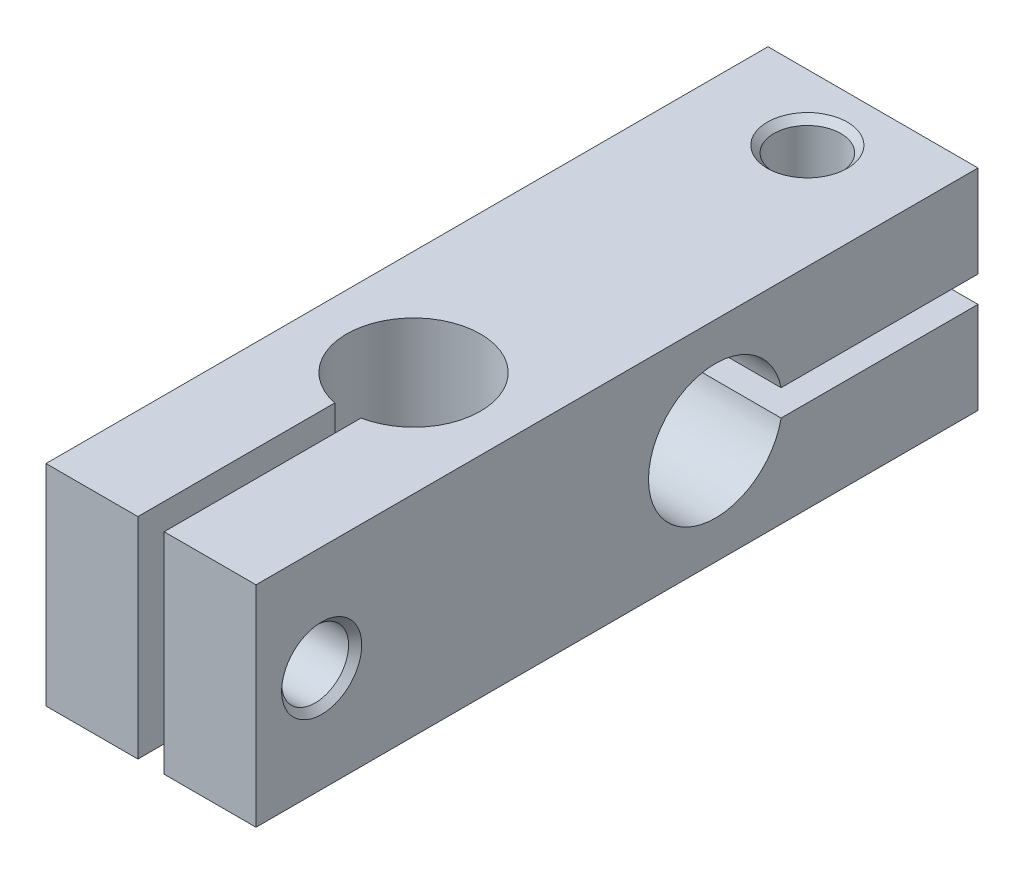
ISO-10303-21;
HEADER;
FILE_DESCRIPTION(('STEP AP214'),'2;1');
FILE_NAME('part.step','',(''),(''),'','','');
FILE_SCHEMA(('AUTOMOTIVE_DESIGN { 1 0 10303 214 1 1 1 1 }'));
ENDSEC;
DATA;
#1=APPLICATION_CONTEXT('core data for automotive mechanical design processes');
#2=APPLICATION_PROTOCOL_DEFINITION('international standard','automotive_design',2000,#1);
#3=PRODUCT_CONTEXT('',#1,'mechanical');
#4=PRODUCT('Part','Part','',(#3));
#5=PRODUCT_RELATED_PRODUCT_CATEGORY('part','',(#4));
#6=PRODUCT_DEFINITION_FORMATION('','',#4);
#7=PRODUCT_DEFINITION_CONTEXT('part definition',#1,'design');
#8=PRODUCT_DEFINITION('design','',#6,#7);
#9=PRODUCT_DEFINITION_SHAPE('','',#8);
#10=(LENGTH_UNIT() NAMED_UNIT(*) SI_UNIT(.MILLI.,.METRE.));
#11=(NAMED_UNIT(*) PLANE_ANGLE_UNIT() SI_UNIT($,.RADIAN.));
#12=(NAMED_UNIT(*) SI_UNIT($,.STERADIAN.) SOLID_ANGLE_UNIT());
#13=UNCERTAINTY_MEASURE_WITH_UNIT(LENGTH_MEASURE(1.E-05),#10,'distance_accuracy_value','');
#14=(GEOMETRIC_REPRESENTATION_CONTEXT(3) GLOBAL_UNCERTAINTY_ASSIGNED_CONTEXT((#13)) GLOBAL_UNIT_ASSIGNED_CONTEXT((#10,
#11,#12)) REPRESENTATION_CONTEXT('',''));
#15=CARTESIAN_POINT('',(0.,0.,0.));
#16=DIRECTION('',(0.,0.,1.));
#17=DIRECTION('',(1.,0.,0.));
#18=AXIS2_PLACEMENT_3D('',#15,#16,#17);
#19=CARTESIAN_POINT('',(0.,0.,0.));
#20=DIRECTION('',(0.,0.,1.));
#21=DIRECTION('',(1.,0.,0.));
#22=AXIS2_PLACEMENT_3D('',#19,#20,#21);
#23=PLANE('',#22);
#24=DIRECTION('',(0.,1.,0.));
#25=VECTOR('',#24,1.);
#26=CARTESIAN_POINT('',(8.,-8.,0.));
#27=LINE('',#26,#25);
#28=CARTESIAN_POINT('',(8.,1.,0.));
#29=VERTEX_POINT('',#28);
#30=CARTESIAN_POINT('',(8.,8.,0.));
#31=VERTEX_POINT('',#30);
#32=EDGE_CURVE('E209',#29,#31,#27,.T.);
#33=ORIENTED_EDGE('',*,*,#32,.F.);
#34=DIRECTION('',(-1.,0.,0.));
#35=VECTOR('',#34,1.);
#36=CARTESIAN_POINT('',(8.,1.,0.));
#37=LINE('',#36,#35);
#38=CARTESIAN_POINT('',(-8.,1.,0.));
#39=VERTEX_POINT('',#38);
#40=EDGE_CURVE('E140',#29,#39,#37,.T.);
#41=ORIENTED_EDGE('',*,*,#40,.T.);
#42=DIRECTION('',(0.,-1.,0.));
#43=VECTOR('',#42,1.);
#44=CARTESIAN_POINT('',(-8.,-8.,0.));
#45=LINE('',#44,#43);
#46=CARTESIAN_POINT('',(-8.,8.,0.));
#47=VERTEX_POINT('',#46);
#48=EDGE_CURVE('E204',#47,#39,#45,.T.);
#49=ORIENTED_EDGE('',*,*,#48,.F.);
#50=DIRECTION('',(-1.,0.,0.));
#51=VECTOR('',#50,1.);
#52=CARTESIAN_POINT('',(8.,8.,0.));
#53=LINE('',#52,#51);
#54=EDGE_CURVE('E193',#31,#47,#53,.T.);
#55=ORIENTED_EDGE('',*,*,#54,.F.);
#56=EDGE_LOOP('',(#33,#41,#49,#55));
#57=FACE_BOUND('',#56,.T.);
#58=ADVANCED_FACE('F36',(#57),#23,.F.);
#59=CARTESIAN_POINT('',(8.,8.,55.));
#60=DIRECTION('',(0.,-1.,0.));
#61=DIRECTION('',(1.,0.,0.));
#62=AXIS2_PLACEMENT_3D('',#59,#60,#61);
#63=PLANE('',#62);
#64=CARTESIAN_POINT('',(0.,8.,5.));
#65=DIRECTION('',(0.,1.,0.));
#66=DIRECTION('',(0.,0.,1.));
#67=AXIS2_PLACEMENT_3D('',#64,#65,#66);
#68=CIRCLE('',#67,3.05);
#69=CARTESIAN_POINT('',(0.,8.,8.05));
#70=VERTEX_POINT('',#69);
#71=EDGE_CURVE('E266',#70,#70,#68,.T.);
#72=ORIENTED_EDGE('',*,*,#71,.F.);
#73=EDGE_LOOP('',(#72));
#74=FACE_BOUND('',#73,.T.);
#75=CARTESIAN_POINT('',(0.,8.,35.));
#76=DIRECTION('',(0.,1.,0.));
#77=DIRECTION('',(0.,0.,1.));
#78=AXIS2_PLACEMENT_3D('',#75,#76,#77);
#79=CIRCLE('',#78,5.09999999999999);
#80=CARTESIAN_POINT('',(1.,8.,40.00099990002));
#81=VERTEX_POINT('',#80);
#82=CARTESIAN_POINT('',(-0.999999999999997,8.,40.00099990002));
#83=VERTEX_POINT('',#82);
#84=EDGE_CURVE('E151',#81,#83,#79,.T.);
#85=ORIENTED_EDGE('',*,*,#84,.F.);
#86=DIRECTION('',(0.,0.,-1.));
#87=VECTOR('',#86,1.);
#88=CARTESIAN_POINT('',(1.00000000000001,8.,0.));
#89=LINE('',#88,#87);
#90=CARTESIAN_POINT('',(1.00000000000001,8.,55.));
#91=VERTEX_POINT('',#90);
#92=EDGE_CURVE('E175',#91,#81,#89,.T.);
#93=ORIENTED_EDGE('',*,*,#92,.F.);
#94=DIRECTION('',(-1.,0.,0.));
#95=VECTOR('',#94,1.);
#96=CARTESIAN_POINT('',(8.,8.,55.));
#97=LINE('',#96,#95);
#98=CARTESIAN_POINT('',(8.,8.,55.));
#99=VERTEX_POINT('',#98);
#100=EDGE_CURVE('E200',#99,#91,#97,.T.);
#101=ORIENTED_EDGE('',*,*,#100,.F.);
#102=DIRECTION('',(0.,0.,-1.));
#103=VECTOR('',#102,1.);
#104=CARTESIAN_POINT('',(8.,8.,55.));
#105=LINE('',#104,#103);
#106=EDGE_CURVE('E215',#99,#31,#105,.T.);
#107=ORIENTED_EDGE('',*,*,#106,.T.);
#108=ORIENTED_EDGE('',*,*,#54,.T.);
#109=DIRECTION('',(0.,0.,-1.));
#110=VECTOR('',#109,1.);
#111=CARTESIAN_POINT('',(-8.,8.,55.));
#112=LINE('',#111,#110);
#113=CARTESIAN_POINT('',(-8.,8.,55.));
#114=VERTEX_POINT('',#113);
#115=EDGE_CURVE('E203',#114,#47,#112,.T.);
#116=ORIENTED_EDGE('',*,*,#115,.F.);
#117=CARTESIAN_POINT('',(-0.999999999999997,8.,55.));
#118=VERTEX_POINT('',#117);
#119=EDGE_CURVE('E199',#118,#114,#97,.T.);
#120=ORIENTED_EDGE('',*,*,#119,.F.);
#121=DIRECTION('',(0.,0.,-1.));
#122=VECTOR('',#121,1.);
#123=CARTESIAN_POINT('',(-1.00000000000001,8.,0.));
#124=LINE('',#123,#122);
#125=EDGE_CURVE('E179',#118,#83,#124,.T.);
#126=ORIENTED_EDGE('',*,*,#125,.T.);
#127=EDGE_LOOP('',(#85,#93,#101,#107,#108,#116,#120,#126));
#128=FACE_BOUND('',#127,.T.);
#129=ADVANCED_FACE('F244',(#74,#128),#63,.F.);
#130=CARTESIAN_POINT('',(0.,0.,55.));
#131=DIRECTION('',(0.,0.,1.));
#132=DIRECTION('',(1.,0.,0.));
#133=AXIS2_PLACEMENT_3D('',#130,#131,#132);
#134=PLANE('',#133);
#135=DIRECTION('',(1.,0.,0.));
#136=VECTOR('',#135,1.);
#137=CARTESIAN_POINT('',(8.,-8.,55.));
#138=LINE('',#137,#136);
#139=CARTESIAN_POINT('',(-8.,-8.,55.));
#140=VERTEX_POINT('',#139);
#141=CARTESIAN_POINT('',(-0.999999999999994,-8.,55.));
#142=VERTEX_POINT('',#141);
#143=EDGE_CURVE('E194',#140,#142,#138,.T.);
#144=ORIENTED_EDGE('',*,*,#143,.T.);
#145=DIRECTION('',(0.,1.,0.));
#146=VECTOR('',#145,1.);
#147=CARTESIAN_POINT('',(-0.999999999999994,-8.,55.));
#148=LINE('',#147,#146);
#149=EDGE_CURVE('E178',#142,#118,#148,.T.);
#150=ORIENTED_EDGE('',*,*,#149,.T.);
#151=ORIENTED_EDGE('',*,*,#119,.T.);
#152=DIRECTION('',(0.,-1.,0.));
#153=VECTOR('',#152,1.);
#154=CARTESIAN_POINT('',(-8.,-8.,55.));
#155=LINE('',#154,#153);
#156=EDGE_CURVE('E189',#114,#140,#155,.T.);
#157=ORIENTED_EDGE('',*,*,#156,.T.);
#158=EDGE_LOOP('',(#144,#150,#151,#157));
#159=FACE_BOUND('',#158,.T.);
#160=ADVANCED_FACE('F241',(#159),#134,.T.);
#161=CARTESIAN_POINT('',(-8.,-8.,55.));
#162=DIRECTION('',(1.,0.,0.));
#163=DIRECTION('',(0.,0.,-1.));
#164=AXIS2_PLACEMENT_3D('',#161,#162,#163);
#165=PLANE('',#164);
#166=CARTESIAN_POINT('',(-8.,0.,50.));
#167=DIRECTION('',(-1.,0.,0.));
#168=DIRECTION('',(0.,0.,1.));
#169=AXIS2_PLACEMENT_3D('',#166,#167,#168);
#170=CIRCLE('',#169,2.1);
#171=CARTESIAN_POINT('',(-8.,0.,52.1));
#172=VERTEX_POINT('',#171);
#173=EDGE_CURVE('E160',#172,#172,#170,.T.);
#174=ORIENTED_EDGE('',*,*,#173,.F.);
#175=EDGE_LOOP('',(#174));
#176=FACE_BOUND('',#175,.T.);
#177=DIRECTION('',(0.,0.,-1.));
#178=VECTOR('',#177,1.);
#179=CARTESIAN_POINT('',(-8.,1.,0.));
#180=LINE('',#179,#178);
#181=CARTESIAN_POINT('',(-8.,0.999999999999999,14.99900009998));
#182=VERTEX_POINT('',#181);
#183=EDGE_CURVE('E145',#182,#39,#180,.T.);
#184=ORIENTED_EDGE('',*,*,#183,.F.);
#185=CARTESIAN_POINT('',(-8.,0.,20.));
#186=DIRECTION('',(-1.,0.,0.));
#187=DIRECTION('',(0.,0.,1.));
#188=AXIS2_PLACEMENT_3D('',#185,#186,#187);
#189=CIRCLE('',#188,5.09999999999999);
#190=CARTESIAN_POINT('',(-8.,-0.999999999999999,14.99900009998));
#191=VERTEX_POINT('',#190);
#192=EDGE_CURVE('E126',#191,#182,#189,.T.);
#193=ORIENTED_EDGE('',*,*,#192,.F.);
#194=DIRECTION('',(0.,0.,1.));
#195=VECTOR('',#194,1.);
#196=CARTESIAN_POINT('',(-8.,-1.,0.));
#197=LINE('',#196,#195);
#198=CARTESIAN_POINT('',(-8.,-1.,0.));
#199=VERTEX_POINT('',#198);
#200=EDGE_CURVE('E130',#199,#191,#197,.T.);
#201=ORIENTED_EDGE('',*,*,#200,.F.);
#202=CARTESIAN_POINT('',(-8.,-8.,0.));
#203=VERTEX_POINT('',#202);
#204=EDGE_CURVE('E186',#199,#203,#45,.T.);
#205=ORIENTED_EDGE('',*,*,#204,.T.);
#206=DIRECTION('',(0.,0.,-1.));
#207=VECTOR('',#206,1.);
#208=CARTESIAN_POINT('',(-8.,-8.,55.));
#209=LINE('',#208,#207);
#210=EDGE_CURVE('E221',#140,#203,#209,.T.);
#211=ORIENTED_EDGE('',*,*,#210,.F.);
#212=ORIENTED_EDGE('',*,*,#156,.F.);
#213=ORIENTED_EDGE('',*,*,#115,.T.);
#214=ORIENTED_EDGE('',*,*,#48,.T.);
#215=EDGE_LOOP('',(#184,#193,#201,#205,#211,#212,#213,#214));
#216=FACE_BOUND('',#215,.T.);
#217=ADVANCED_FACE('F38',(#176,#216),#165,.F.);
#218=CARTESIAN_POINT('',(8.,-8.,55.));
#219=DIRECTION('',(0.,1.,0.));
#220=DIRECTION('',(-1.,0.,0.));
#221=AXIS2_PLACEMENT_3D('',#218,#219,#220);
#222=PLANE('',#221);
#223=CARTESIAN_POINT('',(0.,-8.,5.));
#224=DIRECTION('',(0.,-1.,0.));
#225=DIRECTION('',(0.,0.,-1.));
#226=AXIS2_PLACEMENT_3D('',#223,#224,#225);
#227=CIRCLE('',#226,2.09999999999999);
#228=CARTESIAN_POINT('',(0.,-8.,2.90000000000001));
#229=VERTEX_POINT('',#228);
#230=EDGE_CURVE('E272',#229,#229,#227,.T.);
#231=ORIENTED_EDGE('',*,*,#230,.F.);
#232=EDGE_LOOP('',(#231));
#233=FACE_BOUND('',#232,.T.);
#234=DIRECTION('',(0.,0.,-1.));
#235=VECTOR('',#234,1.);
#236=CARTESIAN_POINT('',(1.00000000000001,-8.,0.));
#237=LINE('',#236,#235);
#238=CARTESIAN_POINT('',(1.00000000000001,-8.,55.));
#239=VERTEX_POINT('',#238);
#240=CARTESIAN_POINT('',(1.00000000000001,-8.,40.00099990002));
#241=VERTEX_POINT('',#240);
#242=EDGE_CURVE('E174',#239,#241,#237,.T.);
#243=ORIENTED_EDGE('',*,*,#242,.T.);
#244=CARTESIAN_POINT('',(0.,-8.,35.));
#245=DIRECTION('',(0.,1.,0.));
#246=DIRECTION('',(0.,0.,1.));
#247=AXIS2_PLACEMENT_3D('',#244,#245,#246);
#248=CIRCLE('',#247,5.1);
#249=CARTESIAN_POINT('',(-0.999999999999995,-8.,40.00099990002));
#250=VERTEX_POINT('',#249);
#251=EDGE_CURVE('E154',#241,#250,#248,.T.);
#252=ORIENTED_EDGE('',*,*,#251,.T.);
#253=DIRECTION('',(0.,0.,-1.));
#254=VECTOR('',#253,1.);
#255=CARTESIAN_POINT('',(-1.00000000000001,-8.,0.));
#256=LINE('',#255,#254);
#257=EDGE_CURVE('E171',#142,#250,#256,.T.);
#258=ORIENTED_EDGE('',*,*,#257,.F.);
#259=ORIENTED_EDGE('',*,*,#143,.F.);
#260=ORIENTED_EDGE('',*,*,#210,.T.);
#261=DIRECTION('',(1.,0.,0.));
#262=VECTOR('',#261,1.);
#263=CARTESIAN_POINT('',(8.,-8.,0.));
#264=LINE('',#263,#262);
#265=CARTESIAN_POINT('',(8.,-8.,0.));
#266=VERTEX_POINT('',#265);
#267=EDGE_CURVE('E207',#203,#266,#264,.T.);
#268=ORIENTED_EDGE('',*,*,#267,.T.);
#269=DIRECTION('',(0.,0.,-1.));
#270=VECTOR('',#269,1.);
#271=CARTESIAN_POINT('',(8.,-8.,55.));
#272=LINE('',#271,#270);
#273=CARTESIAN_POINT('',(8.,-8.,55.));
#274=VERTEX_POINT('',#273);
#275=EDGE_CURVE('E218',#274,#266,#272,.T.);
#276=ORIENTED_EDGE('',*,*,#275,.F.);
#277=EDGE_CURVE('E192',#239,#274,#138,.T.);
#278=ORIENTED_EDGE('',*,*,#277,.F.);
#279=EDGE_LOOP('',(#243,#252,#258,#259,#260,#268,#276,#278));
#280=FACE_BOUND('',#279,.T.);
#281=ADVANCED_FACE('F235',(#233,#280),#222,.F.);
#282=CARTESIAN_POINT('',(8.,-8.,55.));
#283=DIRECTION('',(-1.,0.,0.));
#284=DIRECTION('',(0.,0.,1.));
#285=AXIS2_PLACEMENT_3D('',#282,#283,#284);
#286=PLANE('',#285);
#287=CARTESIAN_POINT('',(8.,0.,50.));
#288=DIRECTION('',(1.,0.,0.));
#289=DIRECTION('',(0.,0.,-1.));
#290=AXIS2_PLACEMENT_3D('',#287,#288,#289);
#291=CIRCLE('',#290,3.05);
#292=CARTESIAN_POINT('',(8.,0.,46.95));
#293=VERTEX_POINT('',#292);
#294=EDGE_CURVE('E164',#293,#293,#291,.T.);
#295=ORIENTED_EDGE('',*,*,#294,.F.);
#296=EDGE_LOOP('',(#295));
#297=FACE_BOUND('',#296,.T.);
#298=DIRECTION('',(0.,0.,1.));
#299=VECTOR('',#298,1.);
#300=CARTESIAN_POINT('',(8.,-1.,0.));
#301=LINE('',#300,#299);
#302=CARTESIAN_POINT('',(8.,-1.,0.));
#303=VERTEX_POINT('',#302);
#304=CARTESIAN_POINT('',(8.,-1.,14.99900009998));
#305=VERTEX_POINT('',#304);
#306=EDGE_CURVE('E58',#303,#305,#301,.T.);
#307=ORIENTED_EDGE('',*,*,#306,.T.);
#308=CARTESIAN_POINT('',(8.,0.,20.));
#309=DIRECTION('',(-1.,0.,0.));
#310=DIRECTION('',(0.,0.,1.));
#311=AXIS2_PLACEMENT_3D('',#308,#309,#310);
#312=CIRCLE('',#311,5.1);
#313=CARTESIAN_POINT('',(8.,1.,14.99900009998));
#314=VERTEX_POINT('',#313);
#315=EDGE_CURVE('E52',#305,#314,#312,.T.);
#316=ORIENTED_EDGE('',*,*,#315,.T.);
#317=DIRECTION('',(0.,0.,-1.));
#318=VECTOR('',#317,1.);
#319=CARTESIAN_POINT('',(8.,1.,0.));
#320=LINE('',#319,#318);
#321=EDGE_CURVE('E134',#314,#29,#320,.T.);
#322=ORIENTED_EDGE('',*,*,#321,.T.);
#323=ORIENTED_EDGE('',*,*,#32,.T.);
#324=ORIENTED_EDGE('',*,*,#106,.F.);
#325=DIRECTION('',(0.,1.,0.));
#326=VECTOR('',#325,1.);
#327=CARTESIAN_POINT('',(8.,-8.,55.));
#328=LINE('',#327,#326);
#329=EDGE_CURVE('E197',#274,#99,#328,.T.);
#330=ORIENTED_EDGE('',*,*,#329,.F.);
#331=ORIENTED_EDGE('',*,*,#275,.T.);
#332=EDGE_CURVE('E210',#266,#303,#27,.T.);
#333=ORIENTED_EDGE('',*,*,#332,.T.);
#334=EDGE_LOOP('',(#307,#316,#322,#323,#324,#330,#331,#333));
#335=FACE_BOUND('',#334,.T.);
#336=ADVANCED_FACE('F133',(#297,#335),#286,.F.);
#337=DIRECTION('',(0.,1.,0.));
#338=VECTOR('',#337,1.);
#339=CARTESIAN_POINT('',(1.00000000000001,-8.,55.));
#340=LINE('',#339,#338);
#341=EDGE_CURVE('E184',#239,#91,#340,.T.);
#342=ORIENTED_EDGE('',*,*,#341,.F.);
#343=ORIENTED_EDGE('',*,*,#277,.T.);
#344=ORIENTED_EDGE('',*,*,#329,.T.);
#345=ORIENTED_EDGE('',*,*,#100,.T.);
#346=EDGE_LOOP('',(#342,#343,#344,#345));
#347=FACE_BOUND('',#346,.T.);
#348=ADVANCED_FACE('F284',(#347),#134,.T.);
#349=ORIENTED_EDGE('',*,*,#204,.F.);
#350=DIRECTION('',(-1.,0.,0.));
#351=VECTOR('',#350,1.);
#352=CARTESIAN_POINT('',(8.,-1.,0.));
#353=LINE('',#352,#351);
#354=EDGE_CURVE('E142',#303,#199,#353,.T.);
#355=ORIENTED_EDGE('',*,*,#354,.F.);
#356=ORIENTED_EDGE('',*,*,#332,.F.);
#357=ORIENTED_EDGE('',*,*,#267,.F.);
#358=EDGE_LOOP('',(#349,#355,#356,#357));
#359=FACE_BOUND('',#358,.T.);
#360=ADVANCED_FACE('F258',(#359),#23,.F.);
#361=CARTESIAN_POINT('',(1.00000000000001,-8.,0.));
#362=DIRECTION('',(1.,0.,0.));
#363=DIRECTION('',(0.,1.,0.));
#364=AXIS2_PLACEMENT_3D('',#361,#362,#363);
#365=PLANE('',#364);
#366=CARTESIAN_POINT('',(1.00000000000001,0.,50.));
#367=DIRECTION('',(1.,0.,0.));
#368=DIRECTION('',(0.,1.,0.));
#369=AXIS2_PLACEMENT_3D('',#366,#367,#368);
#370=CIRCLE('',#369,2.54999999999999);
#371=CARTESIAN_POINT('',(1.00000000000001,2.54999999999999,50.));
#372=VERTEX_POINT('',#371);
#373=EDGE_CURVE('E170',#372,#372,#370,.T.);
#374=ORIENTED_EDGE('',*,*,#373,.T.);
#375=EDGE_LOOP('',(#374));
#376=FACE_BOUND('',#375,.T.);
#377=ORIENTED_EDGE('',*,*,#92,.T.);
#378=DIRECTION('',(0.,1.,0.));
#379=VECTOR('',#378,1.);
#380=CARTESIAN_POINT('',(1.00000000000001,8.,40.00099990002));
#381=LINE('',#380,#379);
#382=EDGE_CURVE('E157',#81,#241,#381,.F.);
#383=ORIENTED_EDGE('',*,*,#382,.T.);
#384=ORIENTED_EDGE('',*,*,#242,.F.);
#385=ORIENTED_EDGE('',*,*,#341,.T.);
#386=EDGE_LOOP('',(#377,#383,#384,#385));
#387=FACE_BOUND('',#386,.T.);
#388=ADVANCED_FACE('F298',(#376,#387),#365,.F.);
#389=CARTESIAN_POINT('',(-1.00000000000001,-8.,0.));
#390=DIRECTION('',(1.,0.,0.));
#391=DIRECTION('',(0.,0.,-1.));
#392=AXIS2_PLACEMENT_3D('',#389,#390,#391);
#393=PLANE('',#392);
#394=DIRECTION('',(0.,1.,0.));
#395=VECTOR('',#394,1.);
#396=CARTESIAN_POINT('',(-0.999999999999997,8.,40.00099990002));
#397=LINE('',#396,#395);
#398=EDGE_CURVE('E45',#83,#250,#397,.F.);
#399=ORIENTED_EDGE('',*,*,#398,.F.);
#400=ORIENTED_EDGE('',*,*,#125,.F.);
#401=ORIENTED_EDGE('',*,*,#149,.F.);
#402=ORIENTED_EDGE('',*,*,#257,.T.);
#403=EDGE_LOOP('',(#399,#400,#401,#402));
#404=FACE_BOUND('',#403,.T.);
#405=CARTESIAN_POINT('',(-0.999999999999993,0.,50.));
#406=DIRECTION('',(1.,0.,0.));
#407=DIRECTION('',(0.,0.,-1.));
#408=AXIS2_PLACEMENT_3D('',#405,#406,#407);
#409=CIRCLE('',#408,2.1);
#410=CARTESIAN_POINT('',(-0.999999999999994,0.,47.9));
#411=VERTEX_POINT('',#410);
#412=EDGE_CURVE('E163',#411,#411,#409,.T.);
#413=ORIENTED_EDGE('',*,*,#412,.F.);
#414=EDGE_LOOP('',(#413));
#415=FACE_BOUND('',#414,.T.);
#416=ADVANCED_FACE('F237',(#404,#415),#393,.T.);
#417=CARTESIAN_POINT('',(8.,0.,50.));
#418=DIRECTION('',(1.,0.,0.));
#419=DIRECTION('',(0.,0.,-1.));
#420=AXIS2_PLACEMENT_3D('',#417,#418,#419);
#421=CYLINDRICAL_SURFACE('',#420,2.54999999999999);
#422=CARTESIAN_POINT('',(7.5,0.,50.));
#423=DIRECTION('',(1.,0.,0.));
#424=DIRECTION('',(0.,0.,-1.));
#425=AXIS2_PLACEMENT_3D('',#422,#423,#424);
#426=CIRCLE('',#425,2.55);
#427=CARTESIAN_POINT('',(7.5,0.,47.45));
#428=VERTEX_POINT('',#427);
#429=EDGE_CURVE('E167',#428,#428,#426,.T.);
#430=ORIENTED_EDGE('',*,*,#429,.T.);
#431=EDGE_LOOP('',(#430));
#432=FACE_BOUND('',#431,.T.);
#433=ORIENTED_EDGE('',*,*,#373,.F.);
#434=EDGE_LOOP('',(#433));
#435=FACE_BOUND('',#434,.T.);
#436=ADVANCED_FACE('F428',(#432,#435),#421,.F.);
#437=CARTESIAN_POINT('',(8.,0.,50.));
#438=DIRECTION('',(1.,0.,0.));
#439=DIRECTION('',(0.,0.,-1.));
#440=AXIS2_PLACEMENT_3D('',#437,#438,#439);
#441=CONICAL_SURFACE('',#440,3.05,0.78539816339745);
#442=ORIENTED_EDGE('',*,*,#429,.F.);
#443=EDGE_LOOP('',(#442));
#444=FACE_BOUND('',#443,.T.);
#445=ORIENTED_EDGE('',*,*,#294,.T.);
#446=EDGE_LOOP('',(#445));
#447=FACE_BOUND('',#446,.T.);
#448=ADVANCED_FACE('F405',(#444,#447),#441,.F.);
#449=CARTESIAN_POINT('',(-8.,0.,50.));
#450=DIRECTION('',(-1.,0.,0.));
#451=DIRECTION('',(0.,0.,1.));
#452=AXIS2_PLACEMENT_3D('',#449,#450,#451);
#453=CYLINDRICAL_SURFACE('',#452,2.1);
#454=ORIENTED_EDGE('',*,*,#412,.T.);
#455=EDGE_LOOP('',(#454));
#456=FACE_BOUND('',#455,.T.);
#457=ORIENTED_EDGE('',*,*,#173,.T.);
#458=EDGE_LOOP('',(#457));
#459=FACE_BOUND('',#458,.T.);
#460=ADVANCED_FACE('F401',(#456,#459),#453,.F.);
#461=CARTESIAN_POINT('',(0.,8.,35.));
#462=DIRECTION('',(0.,1.,0.));
#463=DIRECTION('',(0.,0.,1.));
#464=AXIS2_PLACEMENT_3D('',#461,#462,#463);
#465=CYLINDRICAL_SURFACE('',#464,5.09999999999999);
#466=ORIENTED_EDGE('',*,*,#84,.T.);
#467=ORIENTED_EDGE('',*,*,#398,.T.);
#468=ORIENTED_EDGE('',*,*,#251,.F.);
#469=ORIENTED_EDGE('',*,*,#382,.F.);
#470=EDGE_LOOP('',(#466,#467,#468,#469));
#471=FACE_BOUND('',#470,.T.);
#472=ADVANCED_FACE('F230',(#471),#465,.F.);
#473=CARTESIAN_POINT('',(8.,1.,0.));
#474=DIRECTION('',(0.,1.,0.));
#475=DIRECTION('',(0.,0.,1.));
#476=AXIS2_PLACEMENT_3D('',#473,#474,#475);
#477=PLANE('',#476);
#478=CARTESIAN_POINT('',(0.,1.,5.));
#479=DIRECTION('',(0.,1.,0.));
#480=DIRECTION('',(0.,0.,1.));
#481=AXIS2_PLACEMENT_3D('',#478,#479,#480);
#482=CIRCLE('',#481,2.54999999999999);
#483=CARTESIAN_POINT('',(0.,1.,7.54999999999999));
#484=VERTEX_POINT('',#483);
#485=EDGE_CURVE('E40',#484,#484,#482,.T.);
#486=ORIENTED_EDGE('',*,*,#485,.T.);
#487=EDGE_LOOP('',(#486));
#488=FACE_BOUND('',#487,.T.);
#489=ORIENTED_EDGE('',*,*,#321,.F.);
#490=DIRECTION('',(-1.,0.,0.));
#491=VECTOR('',#490,1.);
#492=CARTESIAN_POINT('',(-8.,1.,14.99900009998));
#493=LINE('',#492,#491);
#494=EDGE_CURVE('E123',#314,#182,#493,.T.);
#495=ORIENTED_EDGE('',*,*,#494,.T.);
#496=ORIENTED_EDGE('',*,*,#183,.T.);
#497=ORIENTED_EDGE('',*,*,#40,.F.);
#498=EDGE_LOOP('',(#489,#495,#496,#497));
#499=FACE_BOUND('',#498,.T.);
#500=ADVANCED_FACE('F138',(#488,#499),#477,.F.);
#501=CARTESIAN_POINT('',(8.,-1.,0.));
#502=DIRECTION('',(0.,-1.,0.));
#503=DIRECTION('',(0.,0.,-1.));
#504=AXIS2_PLACEMENT_3D('',#501,#502,#503);
#505=PLANE('',#504);
#506=CARTESIAN_POINT('',(0.,-1.,5.));
#507=DIRECTION('',(0.,-1.,0.));
#508=DIRECTION('',(0.,0.,-1.));
#509=AXIS2_PLACEMENT_3D('',#506,#507,#508);
#510=CIRCLE('',#509,2.09999999999999);
#511=CARTESIAN_POINT('',(0.,-1.,2.90000000000001));
#512=VERTEX_POINT('',#511);
#513=EDGE_CURVE('E269',#512,#512,#510,.T.);
#514=ORIENTED_EDGE('',*,*,#513,.T.);
#515=EDGE_LOOP('',(#514));
#516=FACE_BOUND('',#515,.T.);
#517=ORIENTED_EDGE('',*,*,#200,.T.);
#518=DIRECTION('',(-1.,0.,0.));
#519=VECTOR('',#518,1.);
#520=CARTESIAN_POINT('',(-8.,-1.,14.99900009998));
#521=LINE('',#520,#519);
#522=EDGE_CURVE('E11',#191,#305,#521,.F.);
#523=ORIENTED_EDGE('',*,*,#522,.T.);
#524=ORIENTED_EDGE('',*,*,#306,.F.);
#525=ORIENTED_EDGE('',*,*,#354,.T.);
#526=EDGE_LOOP('',(#517,#523,#524,#525));
#527=FACE_BOUND('',#526,.T.);
#528=ADVANCED_FACE('F259',(#516,#527),#505,.F.);
#529=CARTESIAN_POINT('',(-8.,0.,20.));
#530=DIRECTION('',(-1.,0.,0.));
#531=DIRECTION('',(0.,0.,1.));
#532=AXIS2_PLACEMENT_3D('',#529,#530,#531);
#533=CYLINDRICAL_SURFACE('',#532,5.09999999999999);
#534=ORIENTED_EDGE('',*,*,#315,.F.);
#535=ORIENTED_EDGE('',*,*,#522,.F.);
#536=ORIENTED_EDGE('',*,*,#192,.T.);
#537=ORIENTED_EDGE('',*,*,#494,.F.);
#538=EDGE_LOOP('',(#534,#535,#536,#537));
#539=FACE_BOUND('',#538,.T.);
#540=ADVANCED_FACE('F124',(#539),#533,.F.);
#541=CARTESIAN_POINT('',(0.,8.,5.));
#542=DIRECTION('',(0.,1.,0.));
#543=DIRECTION('',(0.,0.,1.));
#544=AXIS2_PLACEMENT_3D('',#541,#542,#543);
#545=CYLINDRICAL_SURFACE('',#544,2.54999999999999);
#546=CARTESIAN_POINT('',(0.,7.5,5.));
#547=DIRECTION('',(0.,1.,0.));
#548=DIRECTION('',(0.,0.,1.));
#549=AXIS2_PLACEMENT_3D('',#546,#547,#548);
#550=CIRCLE('',#549,2.55);
#551=CARTESIAN_POINT('',(0.,7.5,7.55));
#552=VERTEX_POINT('',#551);
#553=EDGE_CURVE('E262',#552,#552,#550,.T.);
#554=ORIENTED_EDGE('',*,*,#553,.T.);
#555=EDGE_LOOP('',(#554));
#556=FACE_BOUND('',#555,.T.);
#557=ORIENTED_EDGE('',*,*,#485,.F.);
#558=EDGE_LOOP('',(#557));
#559=FACE_BOUND('',#558,.T.);
#560=ADVANCED_FACE('F337',(#556,#559),#545,.F.);
#561=CARTESIAN_POINT('',(0.,8.,5.));
#562=DIRECTION('',(0.,1.,0.));
#563=DIRECTION('',(0.,0.,1.));
#564=AXIS2_PLACEMENT_3D('',#561,#562,#563);
#565=CONICAL_SURFACE('',#564,3.05,0.78539816339745);
#566=ORIENTED_EDGE('',*,*,#553,.F.);
#567=EDGE_LOOP('',(#566));
#568=FACE_BOUND('',#567,.T.);
#569=ORIENTED_EDGE('',*,*,#71,.T.);
#570=EDGE_LOOP('',(#569));
#571=FACE_BOUND('',#570,.T.);
#572=ADVANCED_FACE('F366',(#568,#571),#565,.F.);
#573=CARTESIAN_POINT('',(0.,-8.,5.));
#574=DIRECTION('',(0.,-1.,0.));
#575=DIRECTION('',(0.,0.,-1.));
#576=AXIS2_PLACEMENT_3D('',#573,#574,#575);
#577=CYLINDRICAL_SURFACE('',#576,2.09999999999999);
#578=ORIENTED_EDGE('',*,*,#230,.T.);
#579=EDGE_LOOP('',(#578));
#580=FACE_BOUND('',#579,.T.);
#581=ORIENTED_EDGE('',*,*,#513,.F.);
#582=EDGE_LOOP('',(#581));
#583=FACE_BOUND('',#582,.T.);
#584=ADVANCED_FACE('F276',(#580,#583),#577,.F.);
#585=CLOSED_SHELL('',(#58,#129,#160,#217,#281,#336,#348,#360,#388,#416,#436,#448,#460,#472,#500,
#528,#540,#560,#572,#584));
#586=MANIFOLD_SOLID_BREP('B2',#585);
#587=ADVANCED_BREP_SHAPE_REPRESENTATION('',(#18,#586),#14);
#588=SHAPE_DEFINITION_REPRESENTATION(#9,#587);
ENDSEC;
END-ISO-10303-21;
